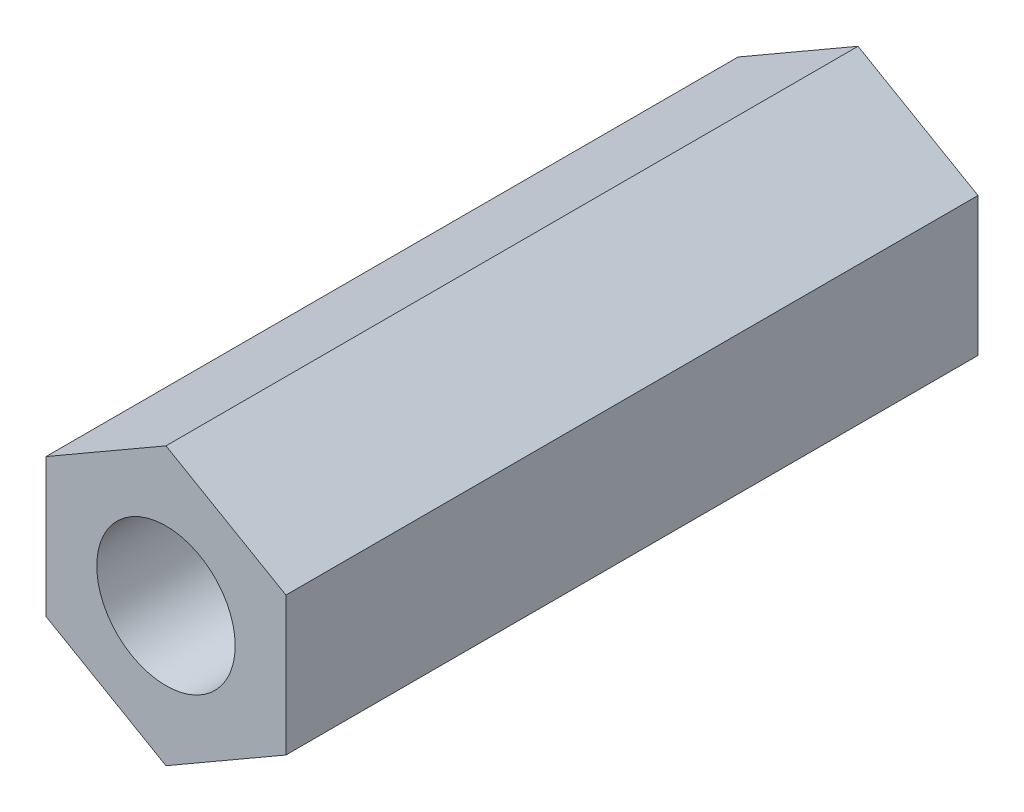
ISO-10303-21;
HEADER;
FILE_DESCRIPTION(('STEP AP214'),'2;1');
FILE_NAME('part.step','',(''),(''),'','','');
FILE_SCHEMA(('AUTOMOTIVE_DESIGN { 1 0 10303 214 1 1 1 1 }'));
ENDSEC;
DATA;
#1=APPLICATION_CONTEXT('core data for automotive mechanical design processes');
#2=APPLICATION_PROTOCOL_DEFINITION('international standard','automotive_design',2000,#1);
#3=PRODUCT_CONTEXT('',#1,'mechanical');
#4=PRODUCT('Part','Part','',(#3));
#5=PRODUCT_RELATED_PRODUCT_CATEGORY('part','',(#4));
#6=PRODUCT_DEFINITION_FORMATION('','',#4);
#7=PRODUCT_DEFINITION_CONTEXT('part definition',#1,'design');
#8=PRODUCT_DEFINITION('design','',#6,#7);
#9=PRODUCT_DEFINITION_SHAPE('','',#8);
#10=(LENGTH_UNIT() NAMED_UNIT(*) SI_UNIT(.MILLI.,.METRE.));
#11=(NAMED_UNIT(*) PLANE_ANGLE_UNIT() SI_UNIT($,.RADIAN.));
#12=(NAMED_UNIT(*) SI_UNIT($,.STERADIAN.) SOLID_ANGLE_UNIT());
#13=UNCERTAINTY_MEASURE_WITH_UNIT(LENGTH_MEASURE(1.E-05),#10,'distance_accuracy_value','');
#14=(GEOMETRIC_REPRESENTATION_CONTEXT(3) GLOBAL_UNCERTAINTY_ASSIGNED_CONTEXT((#13)) GLOBAL_UNIT_ASSIGNED_CONTEXT((#10,
#11,#12)) REPRESENTATION_CONTEXT('',''));
#15=CARTESIAN_POINT('',(0.,0.,0.));
#16=DIRECTION('',(0.,0.,1.));
#17=DIRECTION('',(1.,0.,0.));
#18=AXIS2_PLACEMENT_3D('',#15,#16,#17);
#19=CARTESIAN_POINT('',(-2.6,1.50111069989303,15.));
#20=DIRECTION('',(1.,0.,0.));
#21=DIRECTION('',(0.,0.,-1.));
#22=AXIS2_PLACEMENT_3D('',#19,#20,#21);
#23=PLANE('',#22);
#24=DIRECTION('',(0.,-1.,0.));
#25=VECTOR('',#24,1.);
#26=CARTESIAN_POINT('',(-2.6,1.50111069989303,0.));
#27=LINE('',#26,#25);
#28=CARTESIAN_POINT('',(-2.6,1.50111069989303,0.));
#29=VERTEX_POINT('',#28);
#30=CARTESIAN_POINT('',(-2.6,-1.50111069989303,0.));
#31=VERTEX_POINT('',#30);
#32=EDGE_CURVE('E113',#29,#31,#27,.T.);
#33=ORIENTED_EDGE('',*,*,#32,.T.);
#34=DIRECTION('',(0.,0.,-1.));
#35=VECTOR('',#34,1.);
#36=CARTESIAN_POINT('',(-2.6,-1.50111069989303,15.));
#37=LINE('',#36,#35);
#38=CARTESIAN_POINT('',(-2.6,-1.50111069989303,15.));
#39=VERTEX_POINT('',#38);
#40=EDGE_CURVE('E10',#39,#31,#37,.T.);
#41=ORIENTED_EDGE('',*,*,#40,.F.);
#42=DIRECTION('',(0.,-1.,0.));
#43=VECTOR('',#42,1.);
#44=CARTESIAN_POINT('',(-2.6,1.50111069989303,15.));
#45=LINE('',#44,#43);
#46=CARTESIAN_POINT('',(-2.6,1.50111069989303,15.));
#47=VERTEX_POINT('',#46);
#48=EDGE_CURVE('E133',#47,#39,#45,.T.);
#49=ORIENTED_EDGE('',*,*,#48,.F.);
#50=DIRECTION('',(0.,0.,-1.));
#51=VECTOR('',#50,1.);
#52=CARTESIAN_POINT('',(-2.6,1.50111069989303,15.));
#53=LINE('',#52,#51);
#54=EDGE_CURVE('E19',#47,#29,#53,.T.);
#55=ORIENTED_EDGE('',*,*,#54,.T.);
#56=EDGE_LOOP('',(#33,#41,#49,#55));
#57=FACE_BOUND('',#56,.T.);
#58=ADVANCED_FACE('F16',(#57),#23,.F.);
#59=CARTESIAN_POINT('',(-2.6,-1.50111069989302,15.));
#60=DIRECTION('',(0.5,0.866025403784437,0.));
#61=DIRECTION('',(-0.866025403784437,0.5,0.));
#62=AXIS2_PLACEMENT_3D('',#59,#60,#61);
#63=PLANE('',#62);
#64=DIRECTION('',(0.866025403784437,-0.5,0.));
#65=VECTOR('',#64,1.);
#66=CARTESIAN_POINT('',(-2.6,-1.50111069989302,0.));
#67=LINE('',#66,#65);
#68=CARTESIAN_POINT('',(0.,-3.00222139978606,0.));
#69=VERTEX_POINT('',#68);
#70=EDGE_CURVE('E117',#31,#69,#67,.T.);
#71=ORIENTED_EDGE('',*,*,#70,.T.);
#72=DIRECTION('',(0.,0.,-1.));
#73=VECTOR('',#72,1.);
#74=CARTESIAN_POINT('',(0.,-3.00222139978606,15.));
#75=LINE('',#74,#73);
#76=CARTESIAN_POINT('',(0.,-3.00222139978606,15.));
#77=VERTEX_POINT('',#76);
#78=EDGE_CURVE('E26',#77,#69,#75,.T.);
#79=ORIENTED_EDGE('',*,*,#78,.F.);
#80=DIRECTION('',(0.866025403784437,-0.5,0.));
#81=VECTOR('',#80,1.);
#82=CARTESIAN_POINT('',(-2.6,-1.50111069989302,15.));
#83=LINE('',#82,#81);
#84=EDGE_CURVE('E84',#39,#77,#83,.T.);
#85=ORIENTED_EDGE('',*,*,#84,.F.);
#86=ORIENTED_EDGE('',*,*,#40,.T.);
#87=EDGE_LOOP('',(#71,#79,#85,#86));
#88=FACE_BOUND('',#87,.T.);
#89=ADVANCED_FACE('F271',(#88),#63,.F.);
#90=CARTESIAN_POINT('',(0.,-3.00222139978606,15.));
#91=DIRECTION('',(-0.5,0.866025403784441,0.));
#92=DIRECTION('',(-0.866025403784441,-0.5,0.));
#93=AXIS2_PLACEMENT_3D('',#90,#91,#92);
#94=PLANE('',#93);
#95=DIRECTION('',(0.866025403784441,0.5,0.));
#96=VECTOR('',#95,1.);
#97=CARTESIAN_POINT('',(0.,-3.00222139978606,0.));
#98=LINE('',#97,#96);
#99=CARTESIAN_POINT('',(2.6,-1.50111069989304,0.));
#100=VERTEX_POINT('',#99);
#101=EDGE_CURVE('E93',#69,#100,#98,.T.);
#102=ORIENTED_EDGE('',*,*,#101,.T.);
#103=DIRECTION('',(0.,0.,-1.));
#104=VECTOR('',#103,1.);
#105=CARTESIAN_POINT('',(2.6,-1.50111069989304,15.));
#106=LINE('',#105,#104);
#107=CARTESIAN_POINT('',(2.6,-1.50111069989304,15.));
#108=VERTEX_POINT('',#107);
#109=EDGE_CURVE('E90',#108,#100,#106,.T.);
#110=ORIENTED_EDGE('',*,*,#109,.F.);
#111=DIRECTION('',(0.866025403784441,0.5,0.));
#112=VECTOR('',#111,1.);
#113=CARTESIAN_POINT('',(0.,-3.00222139978606,15.));
#114=LINE('',#113,#112);
#115=EDGE_CURVE('E78',#77,#108,#114,.T.);
#116=ORIENTED_EDGE('',*,*,#115,.F.);
#117=ORIENTED_EDGE('',*,*,#78,.T.);
#118=EDGE_LOOP('',(#102,#110,#116,#117));
#119=FACE_BOUND('',#118,.T.);
#120=ADVANCED_FACE('F91',(#119),#94,.F.);
#121=CARTESIAN_POINT('',(2.6,-1.50111069989303,15.));
#122=DIRECTION('',(-1.,0.,0.));
#123=DIRECTION('',(0.,0.,1.));
#124=AXIS2_PLACEMENT_3D('',#121,#122,#123);
#125=PLANE('',#124);
#126=DIRECTION('',(0.,1.,0.));
#127=VECTOR('',#126,1.);
#128=CARTESIAN_POINT('',(2.6,-1.50111069989303,0.));
#129=LINE('',#128,#127);
#130=CARTESIAN_POINT('',(2.6,1.50111069989303,0.));
#131=VERTEX_POINT('',#130);
#132=EDGE_CURVE('E57',#100,#131,#129,.T.);
#133=ORIENTED_EDGE('',*,*,#132,.T.);
#134=DIRECTION('',(0.,0.,-1.));
#135=VECTOR('',#134,1.);
#136=CARTESIAN_POINT('',(2.6,1.50111069989303,15.));
#137=LINE('',#136,#135);
#138=CARTESIAN_POINT('',(2.6,1.50111069989303,15.));
#139=VERTEX_POINT('',#138);
#140=EDGE_CURVE('E95',#139,#131,#137,.T.);
#141=ORIENTED_EDGE('',*,*,#140,.F.);
#142=DIRECTION('',(0.,1.,0.));
#143=VECTOR('',#142,1.);
#144=CARTESIAN_POINT('',(2.6,-1.50111069989303,15.));
#145=LINE('',#144,#143);
#146=EDGE_CURVE('E83',#108,#139,#145,.T.);
#147=ORIENTED_EDGE('',*,*,#146,.F.);
#148=ORIENTED_EDGE('',*,*,#109,.T.);
#149=EDGE_LOOP('',(#133,#141,#147,#148));
#150=FACE_BOUND('',#149,.T.);
#151=ADVANCED_FACE('F97',(#150),#125,.F.);
#152=CARTESIAN_POINT('',(2.6,1.50111069989303,15.));
#153=DIRECTION('',(-0.5,-0.866025403784438,0.));
#154=DIRECTION('',(0.866025403784438,-0.5,0.));
#155=AXIS2_PLACEMENT_3D('',#152,#153,#154);
#156=PLANE('',#155);
#157=DIRECTION('',(-0.866025403784438,0.5,0.));
#158=VECTOR('',#157,1.);
#159=CARTESIAN_POINT('',(2.6,1.50111069989303,0.));
#160=LINE('',#159,#158);
#161=CARTESIAN_POINT('',(0.,3.00222139978606,0.));
#162=VERTEX_POINT('',#161);
#163=EDGE_CURVE('E63',#131,#162,#160,.T.);
#164=ORIENTED_EDGE('',*,*,#163,.T.);
#165=DIRECTION('',(0.,0.,-1.));
#166=VECTOR('',#165,1.);
#167=CARTESIAN_POINT('',(0.,3.00222139978606,15.));
#168=LINE('',#167,#166);
#169=CARTESIAN_POINT('',(0.,3.00222139978606,15.));
#170=VERTEX_POINT('',#169);
#171=EDGE_CURVE('E134',#170,#162,#168,.T.);
#172=ORIENTED_EDGE('',*,*,#171,.F.);
#173=DIRECTION('',(-0.866025403784438,0.5,0.));
#174=VECTOR('',#173,1.);
#175=CARTESIAN_POINT('',(2.6,1.50111069989303,15.));
#176=LINE('',#175,#174);
#177=EDGE_CURVE('E34',#139,#170,#176,.T.);
#178=ORIENTED_EDGE('',*,*,#177,.F.);
#179=ORIENTED_EDGE('',*,*,#140,.T.);
#180=EDGE_LOOP('',(#164,#172,#178,#179));
#181=FACE_BOUND('',#180,.T.);
#182=ADVANCED_FACE('F240',(#181),#156,.F.);
#183=CARTESIAN_POINT('',(0.,3.00222139978606,15.));
#184=DIRECTION('',(0.5,-0.866025403784439,0.));
#185=DIRECTION('',(0.86602540378444,0.5,0.));
#186=AXIS2_PLACEMENT_3D('',#183,#184,#185);
#187=PLANE('',#186);
#188=DIRECTION('',(-0.866025403784439,-0.5,0.));
#189=VECTOR('',#188,1.);
#190=CARTESIAN_POINT('',(0.,3.00222139978606,0.));
#191=LINE('',#190,#189);
#192=EDGE_CURVE('E126',#162,#29,#191,.T.);
#193=ORIENTED_EDGE('',*,*,#192,.T.);
#194=ORIENTED_EDGE('',*,*,#54,.F.);
#195=DIRECTION('',(-0.866025403784439,-0.5,0.));
#196=VECTOR('',#195,1.);
#197=CARTESIAN_POINT('',(0.,3.00222139978606,15.));
#198=LINE('',#197,#196);
#199=EDGE_CURVE('E69',#170,#47,#198,.T.);
#200=ORIENTED_EDGE('',*,*,#199,.F.);
#201=ORIENTED_EDGE('',*,*,#171,.T.);
#202=EDGE_LOOP('',(#193,#194,#200,#201));
#203=FACE_BOUND('',#202,.T.);
#204=ADVANCED_FACE('F150',(#203),#187,.F.);
#205=CARTESIAN_POINT('',(0.,0.,15.));
#206=DIRECTION('',(0.,0.,-1.));
#207=DIRECTION('',(-1.,0.,0.));
#208=AXIS2_PLACEMENT_3D('',#205,#206,#207);
#209=CYLINDRICAL_SURFACE('',#208,1.5);
#210=CARTESIAN_POINT('',(0.,0.,15.));
#211=DIRECTION('',(0.,0.,1.));
#212=DIRECTION('',(1.,0.,0.));
#213=AXIS2_PLACEMENT_3D('',#210,#211,#212);
#214=CIRCLE('',#213,1.5);
#215=CARTESIAN_POINT('',(1.5,0.,15.));
#216=VERTEX_POINT('',#215);
#217=EDGE_CURVE('E109',#216,#216,#214,.T.);
#218=ORIENTED_EDGE('',*,*,#217,.T.);
#219=EDGE_LOOP('',(#218));
#220=FACE_BOUND('',#219,.T.);
#221=CARTESIAN_POINT('',(0.,0.,0.));
#222=DIRECTION('',(0.,0.,1.));
#223=DIRECTION('',(1.,0.,0.));
#224=AXIS2_PLACEMENT_3D('',#221,#222,#223);
#225=CIRCLE('',#224,1.5);
#226=CARTESIAN_POINT('',(1.5,0.,0.));
#227=VERTEX_POINT('',#226);
#228=EDGE_CURVE('E129',#227,#227,#225,.T.);
#229=ORIENTED_EDGE('',*,*,#228,.F.);
#230=EDGE_LOOP('',(#229));
#231=FACE_BOUND('',#230,.T.);
#232=ADVANCED_FACE('F218',(#220,#231),#209,.F.);
#233=CARTESIAN_POINT('',(0.,0.,15.));
#234=DIRECTION('',(0.,0.,1.));
#235=DIRECTION('',(1.,0.,0.));
#236=AXIS2_PLACEMENT_3D('',#233,#234,#235);
#237=PLANE('',#236);
#238=ORIENTED_EDGE('',*,*,#48,.T.);
#239=ORIENTED_EDGE('',*,*,#84,.T.);
#240=ORIENTED_EDGE('',*,*,#115,.T.);
#241=ORIENTED_EDGE('',*,*,#146,.T.);
#242=ORIENTED_EDGE('',*,*,#177,.T.);
#243=ORIENTED_EDGE('',*,*,#199,.T.);
#244=EDGE_LOOP('',(#238,#239,#240,#241,#242,#243));
#245=FACE_BOUND('',#244,.T.);
#246=ORIENTED_EDGE('',*,*,#217,.F.);
#247=EDGE_LOOP('',(#246));
#248=FACE_BOUND('',#247,.T.);
#249=ADVANCED_FACE('F80',(#245,#248),#237,.T.);
#250=CARTESIAN_POINT('',(0.,0.,0.));
#251=DIRECTION('',(0.,0.,1.));
#252=DIRECTION('',(1.,0.,0.));
#253=AXIS2_PLACEMENT_3D('',#250,#251,#252);
#254=PLANE('',#253);
#255=ORIENTED_EDGE('',*,*,#32,.F.);
#256=ORIENTED_EDGE('',*,*,#192,.F.);
#257=ORIENTED_EDGE('',*,*,#163,.F.);
#258=ORIENTED_EDGE('',*,*,#132,.F.);
#259=ORIENTED_EDGE('',*,*,#101,.F.);
#260=ORIENTED_EDGE('',*,*,#70,.F.);
#261=EDGE_LOOP('',(#255,#256,#257,#258,#259,#260));
#262=FACE_BOUND('',#261,.T.);
#263=ORIENTED_EDGE('',*,*,#228,.T.);
#264=EDGE_LOOP('',(#263));
#265=FACE_BOUND('',#264,.T.);
#266=ADVANCED_FACE('F145',(#262,#265),#254,.F.);
#267=CLOSED_SHELL('',(#58,#89,#120,#151,#182,#204,#232,#249,#266));
#268=MANIFOLD_SOLID_BREP('B1',#267);
#269=ADVANCED_BREP_SHAPE_REPRESENTATION('',(#18,#268),#14);
#270=SHAPE_DEFINITION_REPRESENTATION(#9,#269);
ENDSEC;
END-ISO-10303-21;
